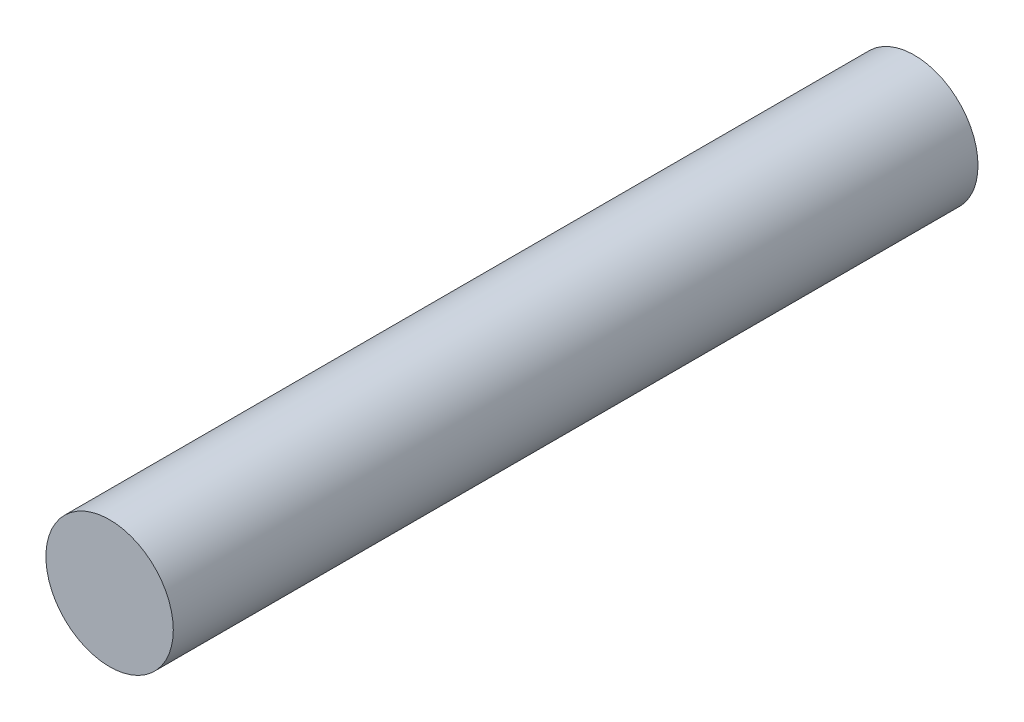
ISO-10303-21;
HEADER;
FILE_DESCRIPTION(('STEP AP214'),'2;1');
FILE_NAME('part.step','',(''),(''),'','','');
FILE_SCHEMA(('AUTOMOTIVE_DESIGN { 1 0 10303 214 1 1 1 1 }'));
ENDSEC;
DATA;
#1=APPLICATION_CONTEXT('core data for automotive mechanical design processes');
#2=APPLICATION_PROTOCOL_DEFINITION('international standard','automotive_design',2000,#1);
#3=PRODUCT_CONTEXT('',#1,'mechanical');
#4=PRODUCT('Part','Part','',(#3));
#5=PRODUCT_RELATED_PRODUCT_CATEGORY('part','',(#4));
#6=PRODUCT_DEFINITION_FORMATION('','',#4);
#7=PRODUCT_DEFINITION_CONTEXT('part definition',#1,'design');
#8=PRODUCT_DEFINITION('design','',#6,#7);
#9=PRODUCT_DEFINITION_SHAPE('','',#8);
#10=(LENGTH_UNIT() NAMED_UNIT(*) SI_UNIT(.MILLI.,.METRE.));
#11=(NAMED_UNIT(*) PLANE_ANGLE_UNIT() SI_UNIT($,.RADIAN.));
#12=(NAMED_UNIT(*) SI_UNIT($,.STERADIAN.) SOLID_ANGLE_UNIT());
#13=UNCERTAINTY_MEASURE_WITH_UNIT(LENGTH_MEASURE(1.E-05),#10,'distance_accuracy_value','');
#14=(GEOMETRIC_REPRESENTATION_CONTEXT(3) GLOBAL_UNCERTAINTY_ASSIGNED_CONTEXT((#13)) GLOBAL_UNIT_ASSIGNED_CONTEXT((#10,
#11,#12)) REPRESENTATION_CONTEXT('',''));
#15=CARTESIAN_POINT('',(0.,0.,0.));
#16=DIRECTION('',(0.,0.,1.));
#17=DIRECTION('',(1.,0.,0.));
#18=AXIS2_PLACEMENT_3D('',#15,#16,#17);
#19=CARTESIAN_POINT('',(-3.74272208638957,-2.15206519967401,48.));
#20=DIRECTION('',(0.,0.,-1.));
#21=DIRECTION('',(-1.,0.,0.));
#22=AXIS2_PLACEMENT_3D('',#19,#20,#21);
#23=CYLINDRICAL_SURFACE('',#22,3.8);
#24=CARTESIAN_POINT('',(-3.74272208638957,-2.15206519967401,48.));
#25=DIRECTION('',(0.,0.,1.));
#26=DIRECTION('',(1.,0.,0.));
#27=AXIS2_PLACEMENT_3D('',#24,#25,#26);
#28=CIRCLE('',#27,3.8);
#29=CARTESIAN_POINT('',(0.0572779136104339,-2.15206519967401,48.));
#30=VERTEX_POINT('',#29);
#31=EDGE_CURVE('E10',#30,#30,#28,.T.);
#32=ORIENTED_EDGE('',*,*,#31,.F.);
#33=EDGE_LOOP('',(#32));
#34=FACE_BOUND('',#33,.T.);
#35=CARTESIAN_POINT('',(-3.74272208638957,-2.15206519967401,0.));
#36=DIRECTION('',(0.,0.,1.));
#37=DIRECTION('',(1.,0.,0.));
#38=AXIS2_PLACEMENT_3D('',#35,#36,#37);
#39=CIRCLE('',#38,3.8);
#40=CARTESIAN_POINT('',(0.0572779136104339,-2.15206519967401,0.));
#41=VERTEX_POINT('',#40);
#42=EDGE_CURVE('E44',#41,#41,#39,.T.);
#43=ORIENTED_EDGE('',*,*,#42,.T.);
#44=EDGE_LOOP('',(#43));
#45=FACE_BOUND('',#44,.T.);
#46=ADVANCED_FACE('F41',(#34,#45),#23,.T.);
#47=CARTESIAN_POINT('',(-3.74272208638957,-2.15206519967401,48.));
#48=DIRECTION('',(0.,0.,1.));
#49=DIRECTION('',(1.,0.,0.));
#50=AXIS2_PLACEMENT_3D('',#47,#48,#49);
#51=PLANE('',#50);
#52=ORIENTED_EDGE('',*,*,#31,.T.);
#53=EDGE_LOOP('',(#52));
#54=FACE_BOUND('',#53,.T.);
#55=ADVANCED_FACE('F58',(#54),#51,.T.);
#56=CARTESIAN_POINT('',(-3.74272208638957,-2.15206519967401,0.));
#57=DIRECTION('',(0.,0.,1.));
#58=DIRECTION('',(1.,0.,0.));
#59=AXIS2_PLACEMENT_3D('',#56,#57,#58);
#60=PLANE('',#59);
#61=ORIENTED_EDGE('',*,*,#42,.F.);
#62=EDGE_LOOP('',(#61));
#63=FACE_BOUND('',#62,.T.);
#64=ADVANCED_FACE('F56',(#63),#60,.F.);
#65=CLOSED_SHELL('',(#46,#55,#64));
#66=MANIFOLD_SOLID_BREP('B2',#65);
#67=ADVANCED_BREP_SHAPE_REPRESENTATION('',(#18,#66),#14);
#68=SHAPE_DEFINITION_REPRESENTATION(#9,#67);
ENDSEC;
END-ISO-10303-21;
